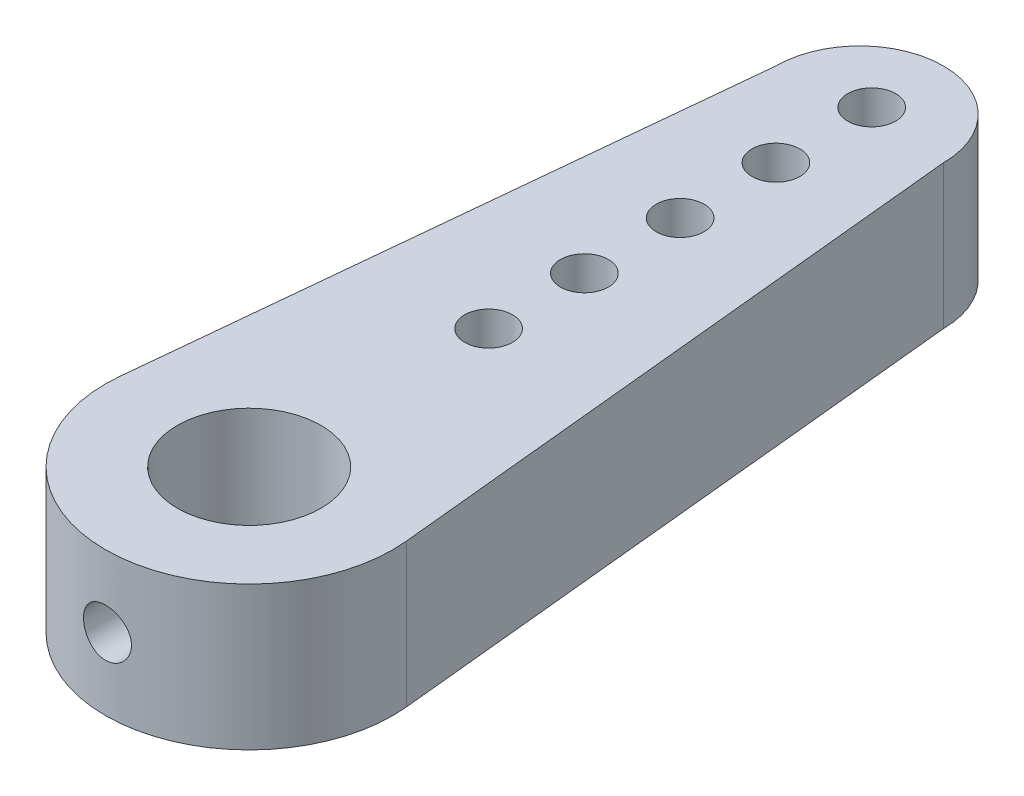
ISO-10303-21;
HEADER;
FILE_DESCRIPTION(('STEP AP214'),'2;1');
FILE_NAME('part.step','',(''),(''),'','','');
FILE_SCHEMA(('AUTOMOTIVE_DESIGN { 1 0 10303 214 1 1 1 1 }'));
ENDSEC;
DATA;
#1=APPLICATION_CONTEXT('core data for automotive mechanical design processes');
#2=APPLICATION_PROTOCOL_DEFINITION('international standard','automotive_design',2000,#1);
#3=PRODUCT_CONTEXT('',#1,'mechanical');
#4=PRODUCT('Part','Part','',(#3));
#5=PRODUCT_RELATED_PRODUCT_CATEGORY('part','',(#4));
#6=PRODUCT_DEFINITION_FORMATION('','',#4);
#7=PRODUCT_DEFINITION_CONTEXT('part definition',#1,'design');
#8=PRODUCT_DEFINITION('design','',#6,#7);
#9=PRODUCT_DEFINITION_SHAPE('','',#8);
#10=(LENGTH_UNIT() NAMED_UNIT(*) SI_UNIT(.MILLI.,.METRE.));
#11=(NAMED_UNIT(*) PLANE_ANGLE_UNIT() SI_UNIT($,.RADIAN.));
#12=(NAMED_UNIT(*) SI_UNIT($,.STERADIAN.) SOLID_ANGLE_UNIT());
#13=UNCERTAINTY_MEASURE_WITH_UNIT(LENGTH_MEASURE(1.E-05),#10,'distance_accuracy_value','');
#14=(GEOMETRIC_REPRESENTATION_CONTEXT(3) GLOBAL_UNCERTAINTY_ASSIGNED_CONTEXT((#13)) GLOBAL_UNIT_ASSIGNED_CONTEXT((#10,
#11,#12)) REPRESENTATION_CONTEXT('',''));
#15=CARTESIAN_POINT('',(0.,0.,0.));
#16=DIRECTION('',(0.,0.,1.));
#17=DIRECTION('',(1.,0.,0.));
#18=AXIS2_PLACEMENT_3D('',#15,#16,#17);
#19=CARTESIAN_POINT('',(0.,3.,-12.75));
#20=DIRECTION('',(0.,1.,0.));
#21=DIRECTION('',(0.,0.,1.));
#22=AXIS2_PLACEMENT_3D('',#19,#20,#21);
#23=PLANE('',#22);
#24=CARTESIAN_POINT('',(0.,3.,-11.));
#25=DIRECTION('',(0.,1.,0.));
#26=DIRECTION('',(0.,0.,1.));
#27=AXIS2_PLACEMENT_3D('',#24,#25,#26);
#28=CIRCLE('',#27,0.5);
#29=CARTESIAN_POINT('',(0.,3.,-10.5));
#30=VERTEX_POINT('',#29);
#31=EDGE_CURVE('E167',#30,#30,#28,.T.);
#32=ORIENTED_EDGE('',*,*,#31,.F.);
#33=EDGE_LOOP('',(#32));
#34=FACE_BOUND('',#33,.T.);
#35=CARTESIAN_POINT('',(0.,3.,-5.));
#36=DIRECTION('',(0.,1.,0.));
#37=DIRECTION('',(0.,0.,1.));
#38=AXIS2_PLACEMENT_3D('',#35,#36,#37);
#39=CIRCLE('',#38,0.5);
#40=CARTESIAN_POINT('',(0.,3.,-4.5));
#41=VERTEX_POINT('',#40);
#42=EDGE_CURVE('E151',#41,#41,#39,.T.);
#43=ORIENTED_EDGE('',*,*,#42,.F.);
#44=EDGE_LOOP('',(#43));
#45=FACE_BOUND('',#44,.T.);
#46=CARTESIAN_POINT('',(0.,3.,0.));
#47=DIRECTION('',(0.,1.,0.));
#48=DIRECTION('',(0.,0.,1.));
#49=AXIS2_PLACEMENT_3D('',#46,#47,#48);
#50=CIRCLE('',#49,1.5);
#51=CARTESIAN_POINT('',(0.,3.,1.5));
#52=VERTEX_POINT('',#51);
#53=EDGE_CURVE('E121',#52,#52,#50,.T.);
#54=ORIENTED_EDGE('',*,*,#53,.F.);
#55=EDGE_LOOP('',(#54));
#56=FACE_BOUND('',#55,.T.);
#57=CARTESIAN_POINT('',(0.,3.,-12.75));
#58=DIRECTION('',(0.,1.,0.));
#59=DIRECTION('',(0.,0.,1.));
#60=AXIS2_PLACEMENT_3D('',#57,#58,#59);
#61=CIRCLE('',#60,1.75);
#62=CARTESIAN_POINT('',(1.75,3.,-12.75));
#63=VERTEX_POINT('',#62);
#64=CARTESIAN_POINT('',(-1.75,3.,-12.75));
#65=VERTEX_POINT('',#64);
#66=EDGE_CURVE('E100',#63,#65,#61,.T.);
#67=ORIENTED_EDGE('',*,*,#66,.T.);
#68=DIRECTION('',(-0.0987095289426616,0.,0.995116289132038));
#69=VECTOR('',#68,1.);
#70=CARTESIAN_POINT('',(-1.75,3.,-12.75));
#71=LINE('',#70,#69);
#72=CARTESIAN_POINT('',(-2.98534886739612,3.,-0.296128586827985));
#73=VERTEX_POINT('',#72);
#74=EDGE_CURVE('E95',#65,#73,#71,.T.);
#75=ORIENTED_EDGE('',*,*,#74,.T.);
#76=CARTESIAN_POINT('',(0.,3.,0.));
#77=DIRECTION('',(0.,1.,0.));
#78=DIRECTION('',(0.,0.,1.));
#79=AXIS2_PLACEMENT_3D('',#76,#77,#78);
#80=CIRCLE('',#79,3.);
#81=CARTESIAN_POINT('',(2.98534886739612,3.,-0.296128586827985));
#82=VERTEX_POINT('',#81);
#83=EDGE_CURVE('E98',#73,#82,#80,.T.);
#84=ORIENTED_EDGE('',*,*,#83,.T.);
#85=DIRECTION('',(-0.0987095289426616,0.,-0.995116289132038));
#86=VECTOR('',#85,1.);
#87=CARTESIAN_POINT('',(1.75,3.,-12.75));
#88=LINE('',#87,#86);
#89=EDGE_CURVE('E65',#82,#63,#88,.T.);
#90=ORIENTED_EDGE('',*,*,#89,.T.);
#91=EDGE_LOOP('',(#67,#75,#84,#90));
#92=FACE_BOUND('',#91,.T.);
#93=CARTESIAN_POINT('',(0.,3.,-7.));
#94=DIRECTION('',(0.,1.,0.));
#95=DIRECTION('',(0.,0.,1.));
#96=AXIS2_PLACEMENT_3D('',#93,#94,#95);
#97=CIRCLE('',#96,0.5);
#98=CARTESIAN_POINT('',(0.,3.,-6.5));
#99=VERTEX_POINT('',#98);
#100=EDGE_CURVE('E143',#99,#99,#97,.T.);
#101=ORIENTED_EDGE('',*,*,#100,.F.);
#102=EDGE_LOOP('',(#101));
#103=FACE_BOUND('',#102,.T.);
#104=CARTESIAN_POINT('',(0.,3.,-9.));
#105=DIRECTION('',(0.,1.,0.));
#106=DIRECTION('',(0.,0.,1.));
#107=AXIS2_PLACEMENT_3D('',#104,#105,#106);
#108=CIRCLE('',#107,0.5);
#109=CARTESIAN_POINT('',(0.,3.,-8.5));
#110=VERTEX_POINT('',#109);
#111=EDGE_CURVE('E159',#110,#110,#108,.T.);
#112=ORIENTED_EDGE('',*,*,#111,.F.);
#113=EDGE_LOOP('',(#112));
#114=FACE_BOUND('',#113,.T.);
#115=CARTESIAN_POINT('',(0.,3.,-13.));
#116=DIRECTION('',(0.,1.,0.));
#117=DIRECTION('',(0.,0.,1.));
#118=AXIS2_PLACEMENT_3D('',#115,#116,#117);
#119=CIRCLE('',#118,0.5);
#120=CARTESIAN_POINT('',(0.,3.,-12.5));
#121=VERTEX_POINT('',#120);
#122=EDGE_CURVE('E175',#121,#121,#119,.T.);
#123=ORIENTED_EDGE('',*,*,#122,.F.);
#124=EDGE_LOOP('',(#123));
#125=FACE_BOUND('',#124,.T.);
#126=ADVANCED_FACE('F41',(#34,#45,#56,#92,#103,#114,#125),#23,.T.);
#127=CARTESIAN_POINT('',(0.,0.,-12.75));
#128=DIRECTION('',(0.,1.,0.));
#129=DIRECTION('',(0.,0.,1.));
#130=AXIS2_PLACEMENT_3D('',#127,#128,#129);
#131=PLANE('',#130);
#132=CARTESIAN_POINT('',(0.,0.,-12.75));
#133=DIRECTION('',(0.,1.,0.));
#134=DIRECTION('',(0.,0.,1.));
#135=AXIS2_PLACEMENT_3D('',#132,#133,#134);
#136=CIRCLE('',#135,1.75);
#137=CARTESIAN_POINT('',(1.75,0.,-12.75));
#138=VERTEX_POINT('',#137);
#139=CARTESIAN_POINT('',(-1.75,0.,-12.75));
#140=VERTEX_POINT('',#139);
#141=EDGE_CURVE('E117',#138,#140,#136,.T.);
#142=ORIENTED_EDGE('',*,*,#141,.F.);
#143=DIRECTION('',(-0.0987095289426616,0.,-0.995116289132038));
#144=VECTOR('',#143,1.);
#145=CARTESIAN_POINT('',(1.75,0.,-12.75));
#146=LINE('',#145,#144);
#147=CARTESIAN_POINT('',(2.98534886739612,0.,-0.296128586827985));
#148=VERTEX_POINT('',#147);
#149=EDGE_CURVE('E88',#148,#138,#146,.T.);
#150=ORIENTED_EDGE('',*,*,#149,.F.);
#151=CARTESIAN_POINT('',(0.,0.,0.));
#152=DIRECTION('',(0.,1.,0.));
#153=DIRECTION('',(0.,0.,1.));
#154=AXIS2_PLACEMENT_3D('',#151,#152,#153);
#155=CIRCLE('',#154,3.);
#156=CARTESIAN_POINT('',(-2.98534886739612,0.,-0.296128586827985));
#157=VERTEX_POINT('',#156);
#158=EDGE_CURVE('E82',#157,#148,#155,.T.);
#159=ORIENTED_EDGE('',*,*,#158,.F.);
#160=DIRECTION('',(-0.0987095289426616,0.,0.995116289132038));
#161=VECTOR('',#160,1.);
#162=CARTESIAN_POINT('',(-1.75,0.,-12.75));
#163=LINE('',#162,#161);
#164=EDGE_CURVE('E105',#140,#157,#163,.T.);
#165=ORIENTED_EDGE('',*,*,#164,.F.);
#166=EDGE_LOOP('',(#142,#150,#159,#165));
#167=FACE_BOUND('',#166,.T.);
#168=CARTESIAN_POINT('',(0.,0.,0.));
#169=DIRECTION('',(0.,1.,0.));
#170=DIRECTION('',(0.,0.,1.));
#171=AXIS2_PLACEMENT_3D('',#168,#169,#170);
#172=CIRCLE('',#171,1.5);
#173=CARTESIAN_POINT('',(0.,0.,1.5));
#174=VERTEX_POINT('',#173);
#175=EDGE_CURVE('E139',#174,#174,#172,.T.);
#176=ORIENTED_EDGE('',*,*,#175,.T.);
#177=EDGE_LOOP('',(#176));
#178=FACE_BOUND('',#177,.T.);
#179=CARTESIAN_POINT('',(0.,0.,-7.));
#180=DIRECTION('',(0.,1.,0.));
#181=DIRECTION('',(0.,0.,1.));
#182=AXIS2_PLACEMENT_3D('',#179,#180,#181);
#183=CIRCLE('',#182,0.5);
#184=CARTESIAN_POINT('',(0.,0.,-6.5));
#185=VERTEX_POINT('',#184);
#186=EDGE_CURVE('E147',#185,#185,#183,.T.);
#187=ORIENTED_EDGE('',*,*,#186,.T.);
#188=EDGE_LOOP('',(#187));
#189=FACE_BOUND('',#188,.T.);
#190=CARTESIAN_POINT('',(0.,0.,-5.));
#191=DIRECTION('',(0.,1.,0.));
#192=DIRECTION('',(0.,0.,1.));
#193=AXIS2_PLACEMENT_3D('',#190,#191,#192);
#194=CIRCLE('',#193,0.5);
#195=CARTESIAN_POINT('',(0.,0.,-4.5));
#196=VERTEX_POINT('',#195);
#197=EDGE_CURVE('E155',#196,#196,#194,.T.);
#198=ORIENTED_EDGE('',*,*,#197,.T.);
#199=EDGE_LOOP('',(#198));
#200=FACE_BOUND('',#199,.T.);
#201=CARTESIAN_POINT('',(0.,0.,-9.));
#202=DIRECTION('',(0.,1.,0.));
#203=DIRECTION('',(0.,0.,1.));
#204=AXIS2_PLACEMENT_3D('',#201,#202,#203);
#205=CIRCLE('',#204,0.5);
#206=CARTESIAN_POINT('',(0.,0.,-8.5));
#207=VERTEX_POINT('',#206);
#208=EDGE_CURVE('E163',#207,#207,#205,.T.);
#209=ORIENTED_EDGE('',*,*,#208,.T.);
#210=EDGE_LOOP('',(#209));
#211=FACE_BOUND('',#210,.T.);
#212=CARTESIAN_POINT('',(0.,0.,-11.));
#213=DIRECTION('',(0.,1.,0.));
#214=DIRECTION('',(0.,0.,1.));
#215=AXIS2_PLACEMENT_3D('',#212,#213,#214);
#216=CIRCLE('',#215,0.5);
#217=CARTESIAN_POINT('',(0.,0.,-10.5));
#218=VERTEX_POINT('',#217);
#219=EDGE_CURVE('E171',#218,#218,#216,.T.);
#220=ORIENTED_EDGE('',*,*,#219,.T.);
#221=EDGE_LOOP('',(#220));
#222=FACE_BOUND('',#221,.T.);
#223=CARTESIAN_POINT('',(0.,0.,-13.));
#224=DIRECTION('',(0.,1.,0.));
#225=DIRECTION('',(0.,0.,1.));
#226=AXIS2_PLACEMENT_3D('',#223,#224,#225);
#227=CIRCLE('',#226,0.5);
#228=CARTESIAN_POINT('',(0.,0.,-12.5));
#229=VERTEX_POINT('',#228);
#230=EDGE_CURVE('E179',#229,#229,#227,.T.);
#231=ORIENTED_EDGE('',*,*,#230,.T.);
#232=EDGE_LOOP('',(#231));
#233=FACE_BOUND('',#232,.T.);
#234=ADVANCED_FACE('F134',(#167,#178,#189,#200,#211,#222,#233),#131,.F.);
#235=CARTESIAN_POINT('',(0.,3.,-12.75));
#236=DIRECTION('',(0.,-1.,0.));
#237=DIRECTION('',(0.,0.,-1.));
#238=AXIS2_PLACEMENT_3D('',#235,#236,#237);
#239=CYLINDRICAL_SURFACE('',#238,1.75);
#240=ORIENTED_EDGE('',*,*,#141,.T.);
#241=DIRECTION('',(0.,-1.,0.));
#242=VECTOR('',#241,1.);
#243=CARTESIAN_POINT('',(-1.75,3.,-12.75));
#244=LINE('',#243,#242);
#245=EDGE_CURVE('E11',#65,#140,#244,.T.);
#246=ORIENTED_EDGE('',*,*,#245,.F.);
#247=ORIENTED_EDGE('',*,*,#66,.F.);
#248=DIRECTION('',(0.,-1.,0.));
#249=VECTOR('',#248,1.);
#250=CARTESIAN_POINT('',(1.75,3.,-12.75));
#251=LINE('',#250,#249);
#252=EDGE_CURVE('E113',#63,#138,#251,.T.);
#253=ORIENTED_EDGE('',*,*,#252,.T.);
#254=EDGE_LOOP('',(#240,#246,#247,#253));
#255=FACE_BOUND('',#254,.T.);
#256=ADVANCED_FACE('F43',(#255),#239,.T.);
#257=CARTESIAN_POINT('',(-1.75,3.,-12.75));
#258=DIRECTION('',(0.995116289132038,0.,0.0987095289426616));
#259=DIRECTION('',(0.0987095289426616,0.,-0.995116289132038));
#260=AXIS2_PLACEMENT_3D('',#257,#258,#259);
#261=PLANE('',#260);
#262=ORIENTED_EDGE('',*,*,#164,.T.);
#263=DIRECTION('',(0.,-1.,0.));
#264=VECTOR('',#263,1.);
#265=CARTESIAN_POINT('',(-2.98534886739612,3.,-0.296128586827985));
#266=LINE('',#265,#264);
#267=EDGE_CURVE('E57',#73,#157,#266,.T.);
#268=ORIENTED_EDGE('',*,*,#267,.F.);
#269=ORIENTED_EDGE('',*,*,#74,.F.);
#270=ORIENTED_EDGE('',*,*,#245,.T.);
#271=EDGE_LOOP('',(#262,#268,#269,#270));
#272=FACE_BOUND('',#271,.T.);
#273=ADVANCED_FACE('F104',(#272),#261,.F.);
#274=CARTESIAN_POINT('',(0.,3.,0.));
#275=DIRECTION('',(0.,-1.,0.));
#276=DIRECTION('',(0.,0.,-1.));
#277=AXIS2_PLACEMENT_3D('',#274,#275,#276);
#278=CYLINDRICAL_SURFACE('',#277,3.);
#279=CARTESIAN_POINT('',(0.5,1.5,2.95803989154981));
#280=CARTESIAN_POINT('',(0.499998879684201,1.47212485037079,2.95804039480255));
#281=CARTESIAN_POINT('',(0.497661033807465,1.44423447879503,2.95843818509613));
#282=CARTESIAN_POINT('',(0.488375485615079,1.38923629135597,2.95998491473636));
#283=CARTESIAN_POINT('',(0.481423532061931,1.3621292212501,2.96113454678286));
#284=CARTESIAN_POINT('',(0.463125908733429,1.30950154332864,2.96405121864465));
#285=CARTESIAN_POINT('',(0.451783910986218,1.28397963026674,2.9658177423439));
#286=CARTESIAN_POINT('',(0.425037299378074,1.23520380905726,2.96976854422868));
#287=CARTESIAN_POINT('',(0.409633142700314,1.21194964608475,2.97195277539495));
#288=CARTESIAN_POINT('',(0.37503750539326,1.16813743005087,2.97651694230522));
#289=CARTESIAN_POINT('',(0.355813809786455,1.1476049737227,2.97889843465414));
#290=CARTESIAN_POINT('',(0.314194400939068,1.1100413386277,2.98357496133892));
#291=CARTESIAN_POINT('',(0.291798499829998,1.09301036737693,2.98586999054394));
#292=CARTESIAN_POINT('',(0.244304573989668,1.06283708655613,2.99013147396494));
#293=CARTESIAN_POINT('',(0.219191216291341,1.04971859845364,2.99209588486455));
#294=CARTESIAN_POINT('',(0.167079124344775,1.02789578589389,2.99545747391431));
#295=CARTESIAN_POINT('',(0.140080512815638,1.01919117442303,2.99685468894535));
#296=CARTESIAN_POINT('',(0.0852287452688485,1.00652149300322,2.99891346944876));
#297=CARTESIAN_POINT('',(0.0573857773358544,1.00251341679906,2.99958170622181));
#298=CARTESIAN_POINT('',(0.00141505710515978,0.999216849169481,3.00013015868556));
#299=CARTESIAN_POINT('',(-0.0267126757057794,0.999928036950553,3.00001042793862));
#300=CARTESIAN_POINT('',(-0.0821604370157749,1.00601627030564,2.99900171686278));
#301=CARTESIAN_POINT('',(-0.109485706140028,1.01134703268183,2.9981203673848));
#302=CARTESIAN_POINT('',(-0.162848395922358,1.0264502148493,2.99569595754327));
#303=CARTESIAN_POINT('',(-0.1888857773303,1.0362227699179,2.99415287702642));
#304=CARTESIAN_POINT('',(-0.239071229556529,1.05997812806306,2.99056539702392));
#305=CARTESIAN_POINT('',(-0.263210104603809,1.07398000241649,2.98851873465376));
#306=CARTESIAN_POINT('',(-0.308813105969328,1.10578256452701,2.984151476143));
#307=CARTESIAN_POINT('',(-0.330277015583175,1.12358355974216,2.98183085783827));
#308=CARTESIAN_POINT('',(-0.370194254689333,1.16273576132386,2.97714053646519));
#309=CARTESIAN_POINT('',(-0.388607900450641,1.1841274189802,2.97477057946208));
#310=CARTESIAN_POINT('',(-0.421590917689612,1.22971741804316,2.97027591956961));
#311=CARTESIAN_POINT('',(-0.436160253706483,1.25391578533656,2.96815121894265));
#312=CARTESIAN_POINT('',(-0.461048886897657,1.3044783283755,2.96438750912363));
#313=CARTESIAN_POINT('',(-0.471363405455848,1.33084489961842,2.9627490466052));
#314=CARTESIAN_POINT('',(-0.487405974163123,1.38496981446151,2.96015237737976));
#315=CARTESIAN_POINT('',(-0.493134428153591,1.41272803528648,2.95919411077664));
#316=CARTESIAN_POINT('',(-0.499786376975853,1.46849323123243,2.95807791884423));
#317=CARTESIAN_POINT('',(-0.500766441582488,1.49649327594042,2.95791057151734));
#318=CARTESIAN_POINT('',(-0.498044540536491,1.55225733433816,2.95837006956472));
#319=CARTESIAN_POINT('',(-0.494342755724932,1.58002135710279,2.95899688426371));
#320=CARTESIAN_POINT('',(-0.482410466985619,1.63434555183817,2.96096537491004));
#321=CARTESIAN_POINT('',(-0.474208758129277,1.6609122279756,2.9623025038367));
#322=CARTESIAN_POINT('',(-0.453539638038455,1.7122940332559,2.96553714601101));
#323=CARTESIAN_POINT('',(-0.441071971620187,1.73710905751018,2.96743469278116));
#324=CARTESIAN_POINT('',(-0.412091334645845,1.78453491888122,2.97159825679479));
#325=CARTESIAN_POINT('',(-0.395542112831872,1.80712331455121,2.9738675112007));
#326=CARTESIAN_POINT('',(-0.358917893141596,1.849222706539,2.97850933335973));
#327=CARTESIAN_POINT('',(-0.338842647276808,1.86873348622195,2.98088190837066));
#328=CARTESIAN_POINT('',(-0.295485614065761,1.90433037854574,2.98549284423653));
#329=CARTESIAN_POINT('',(-0.272172650677239,1.92037876525691,2.98772955268935));
#330=CARTESIAN_POINT('',(-0.223148689589865,1.94833106540098,2.99179022486589));
#331=CARTESIAN_POINT('',(-0.197437769494125,1.96023511289477,2.99361420193995));
#332=CARTESIAN_POINT('',(-0.144459810300265,1.97950211679097,2.99663671633917));
#333=CARTESIAN_POINT('',(-0.117200112520522,1.98688481514698,2.99783796913524));
#334=CARTESIAN_POINT('',(-0.0618061469748419,1.99696311979277,2.99949116633856));
#335=CARTESIAN_POINT('',(-0.0336719513643242,1.99965911174647,2.99994317240036));
#336=CARTESIAN_POINT('',(0.0223082551547368,2.00027637646244,3.00004607577565));
#337=CARTESIAN_POINT('',(0.0501536321205366,1.99825505078821,2.99970660404848));
#338=CARTESIAN_POINT('',(0.105102394862939,1.98961921554612,2.99828435677457));
#339=CARTESIAN_POINT('',(0.132205784793486,1.98300473169809,2.99720158539));
#340=CARTESIAN_POINT('',(0.184879289183719,1.96539236689125,2.99441397765517));
#341=CARTESIAN_POINT('',(0.210451074430805,1.95439936635791,2.99270983408311));
#342=CARTESIAN_POINT('',(0.259396090596393,1.92834841275396,2.9888655137547));
#343=CARTESIAN_POINT('',(0.282769217223493,1.91329026698781,2.98672531632976));
#344=CARTESIAN_POINT('',(0.326942589105432,1.8793329815076,2.98221525923795));
#345=CARTESIAN_POINT('',(0.347710286121123,1.86039180904862,2.97984304910147));
#346=CARTESIAN_POINT('',(0.385792775189609,1.81929433842036,2.97515260660951));
#347=CARTESIAN_POINT('',(0.403106757340238,1.79713728822169,2.97283438702721));
#348=CARTESIAN_POINT('',(0.433902854183923,1.75005093549847,2.9684966871402));
#349=CARTESIAN_POINT('',(0.447356997818908,1.72510313203239,2.96647943596247));
#350=CARTESIAN_POINT('',(0.469862907288183,1.67327815281771,2.96299842044354));
#351=CARTESIAN_POINT('',(0.478919071046321,1.64640293546062,2.96153410350255));
#352=CARTESIAN_POINT('',(0.490405210624429,1.59951924610467,2.95964948967556));
#353=CARTESIAN_POINT('',(0.493997483534056,1.57979463840831,2.95904924684204));
#354=CARTESIAN_POINT('',(0.498795259036485,1.54004930303178,2.95824427057304));
#355=CARTESIAN_POINT('',(0.500000804958385,1.52002858073397,2.95803952995755));
#356=CARTESIAN_POINT('',(0.5,1.5,2.95803989154981));
#357=B_SPLINE_CURVE_WITH_KNOTS('',3,(#279,#280,#281,#282,#283,#284,#285,#286,#287,#288,#289,
#290,#291,#292,#293,#294,#295,#296,#297,#298,#299,#300,#301,#302,#303,#304,#305,#306,#307,#308,
#309,#310,#311,#312,#313,#314,#315,#316,#317,#318,#319,#320,#321,#322,#323,#324,#325,#326,#327,
#328,#329,#330,#331,#332,#333,#334,#335,#336,#337,#338,#339,#340,#341,#342,#343,#344,#345,#346,
#347,#348,#349,#350,#351,#352,#353,#354,#355,#356),.UNSPECIFIED.,.T.,.F.,(4,2,2,2,2,2,2,2,2,2,2,
2,2,2,2,2,2,2,2,2,2,2,2,2,2,2,2,2,2,2,2,2,2,2,2,2,2,2,4),(0.,0.0835522077810638,
0.16718150398389,0.250740999566333,0.334291094801843,0.418578318302725,0.50287053566019,
0.587665960214166,0.672455870213522,0.756463134936426,0.84046468929668,0.923634242320633,
1.00680632849036,1.09035920827015,1.17391885244482,1.25849224691554,1.34306642148333,
1.4277353249885,1.51239677186745,1.59604708483212,1.67969416681925,1.76281212926228,
1.84593506457844,1.9298246855167,2.01372020885267,2.09848822606206,2.18325350094469,
2.26764596882659,2.352031491816,2.43539555252313,2.51875914642894,2.60203007965621,
2.68530496077597,2.7695339949178,2.85378275775492,2.9386274552257,3.02338713347525,
3.08342134107387,3.14345445878998),.UNSPECIFIED.);
#358=CARTESIAN_POINT('',(0.5,1.5,2.95803989154981));
#359=VERTEX_POINT('',#358);
#360=EDGE_CURVE('E183',#359,#359,#357,.T.);
#361=ORIENTED_EDGE('',*,*,#360,.T.);
#362=EDGE_LOOP('',(#361));
#363=FACE_BOUND('',#362,.T.);
#364=ORIENTED_EDGE('',*,*,#158,.T.);
#365=DIRECTION('',(0.,-1.,0.));
#366=VECTOR('',#365,1.);
#367=CARTESIAN_POINT('',(2.98534886739612,3.,-0.296128586827985));
#368=LINE('',#367,#366);
#369=EDGE_CURVE('E107',#82,#148,#368,.T.);
#370=ORIENTED_EDGE('',*,*,#369,.F.);
#371=ORIENTED_EDGE('',*,*,#83,.F.);
#372=ORIENTED_EDGE('',*,*,#267,.T.);
#373=EDGE_LOOP('',(#364,#370,#371,#372));
#374=FACE_BOUND('',#373,.T.);
#375=ADVANCED_FACE('F109',(#363,#374),#278,.T.);
#376=CARTESIAN_POINT('',(1.75,3.,-12.75));
#377=DIRECTION('',(-0.995116289132038,0.,0.0987095289426616));
#378=DIRECTION('',(0.0987095289426616,0.,0.995116289132038));
#379=AXIS2_PLACEMENT_3D('',#376,#377,#378);
#380=PLANE('',#379);
#381=ORIENTED_EDGE('',*,*,#149,.T.);
#382=ORIENTED_EDGE('',*,*,#252,.F.);
#383=ORIENTED_EDGE('',*,*,#89,.F.);
#384=ORIENTED_EDGE('',*,*,#369,.T.);
#385=EDGE_LOOP('',(#381,#382,#383,#384));
#386=FACE_BOUND('',#385,.T.);
#387=ADVANCED_FACE('F131',(#386),#380,.F.);
#388=CARTESIAN_POINT('',(0.,3.,0.));
#389=DIRECTION('',(0.,-1.,0.));
#390=DIRECTION('',(0.,0.,-1.));
#391=AXIS2_PLACEMENT_3D('',#388,#389,#390);
#392=CYLINDRICAL_SURFACE('',#391,1.5);
#393=CARTESIAN_POINT('',(0.5,1.5,1.4142135623731));
#394=CARTESIAN_POINT('',(0.500000128973902,1.47276591259466,1.41421347266367));
#395=CARTESIAN_POINT('',(0.49776739184907,1.44553260011424,1.41500884686403));
#396=CARTESIAN_POINT('',(0.488925565851282,1.39187278952469,1.4180878708729));
#397=CARTESIAN_POINT('',(0.482315756085337,1.36544642506803,1.4203717658361));
#398=CARTESIAN_POINT('',(0.464977742840132,1.31418655349359,1.42614101831944));
#399=CARTESIAN_POINT('',(0.454257610701001,1.28935003527656,1.4296240198232));
#400=CARTESIAN_POINT('',(0.429030814221314,1.2418199757281,1.43739561008504));
#401=CARTESIAN_POINT('',(0.414523314430262,1.21912690872375,1.44168437652716));
#402=CARTESIAN_POINT('',(0.381525573221264,1.17564001883026,1.45077244702794));
#403=CARTESIAN_POINT('',(0.362912170688913,1.15494228566398,1.45558447422069));
#404=CARTESIAN_POINT('',(0.322493833607245,1.11689659938784,1.46506932400754));
#405=CARTESIAN_POINT('',(0.300688387526201,1.09954918420886,1.46974212414549));
#406=CARTESIAN_POINT('',(0.253802253982493,1.06826055133516,1.47856933460829));
#407=CARTESIAN_POINT('',(0.22865095561226,1.05442001469101,1.48270703850784));
#408=CARTESIAN_POINT('',(0.176215611493741,1.03120420743626,1.4898479338551));
#409=CARTESIAN_POINT('',(0.148932142843608,1.02182773341155,1.49285143101506));
#410=CARTESIAN_POINT('',(0.0940144087167468,1.0081320726838,1.49729537715949));
#411=CARTESIAN_POINT('',(0.0664253774264841,1.0036482768715,1.49878657388779));
#412=CARTESIAN_POINT('',(0.0108489374120459,0.99934185331967,1.50021804109124));
#413=CARTESIAN_POINT('',(-0.017138366771946,0.999518024173791,1.50015871131445));
#414=CARTESIAN_POINT('',(-0.0715517575969083,1.00442212728302,1.49853019809368));
#415=CARTESIAN_POINT('',(-0.0979960242958331,1.00897126423725,1.49702032377569));
#416=CARTESIAN_POINT('',(-0.14972171941108,1.02219649049023,1.49273483669855));
#417=CARTESIAN_POINT('',(-0.175003068889587,1.03087285948988,1.48995913815551));
#418=CARTESIAN_POINT('',(-0.224076237421006,1.05221065865307,1.48337835146652));
#419=CARTESIAN_POINT('',(-0.247844110484499,1.06492296927339,1.47956021262158));
#420=CARTESIAN_POINT('',(-0.292962162763584,1.09392985272419,1.47129196519309));
#421=CARTESIAN_POINT('',(-0.314311667192383,1.11022542166331,1.46684168100171));
#422=CARTESIAN_POINT('',(-0.355050433275954,1.14683719673038,1.45753095925538));
#423=CARTESIAN_POINT('',(-0.374300078533783,1.16730657892277,1.45266107586687));
#424=CARTESIAN_POINT('',(-0.409138629797939,1.21122436286128,1.44323667622202));
#425=CARTESIAN_POINT('',(-0.424726971636482,1.23467322285643,1.43868220864403));
#426=CARTESIAN_POINT('',(-0.451993727521386,1.2843268128079,1.43035262569106));
#427=CARTESIAN_POINT('',(-0.4636132318256,1.31056606568463,1.42658954674447));
#428=CARTESIAN_POINT('',(-0.482221596649677,1.36478569713241,1.42040825434116));
#429=CARTESIAN_POINT('',(-0.48921239787748,1.3927653406082,1.41798947731819));
#430=CARTESIAN_POINT('',(-0.498080641044513,1.44831917769667,1.41489818169014));
#431=CARTESIAN_POINT('',(-0.500174547752903,1.47585471236968,1.41415180223172));
#432=CARTESIAN_POINT('',(-0.499802719455807,1.5308880745586,1.41428336096614));
#433=CARTESIAN_POINT('',(-0.497337812612854,1.55838590801528,1.41516100413602));
#434=CARTESIAN_POINT('',(-0.488112825775626,1.61157848285877,1.41836809028099));
#435=CARTESIAN_POINT('',(-0.4815031969902,1.63730271507617,1.42064662715846));
#436=CARTESIAN_POINT('',(-0.464356931280375,1.68727180311884,1.42634276840086));
#437=CARTESIAN_POINT('',(-0.453819598181749,1.71151639579518,1.42976057468663));
#438=CARTESIAN_POINT('',(-0.428737170369428,1.75869021042371,1.4374843879661));
#439=CARTESIAN_POINT('',(-0.414075559179237,1.78155332132096,1.4418151283247));
#440=CARTESIAN_POINT('',(-0.381292815278789,1.8245730261918,1.45082884365827));
#441=CARTESIAN_POINT('',(-0.363170662749394,1.84472881933059,1.45551192221992));
#442=CARTESIAN_POINT('',(-0.322945852950159,1.88276399204534,1.46497519318826));
#443=CARTESIAN_POINT('',(-0.300693635273325,1.90048719500943,1.46974921788922));
#444=CARTESIAN_POINT('',(-0.253413645700129,1.93195807117402,1.47863425806581));
#445=CARTESIAN_POINT('',(-0.228385972432276,1.94570588558121,1.48274529708854));
#446=CARTESIAN_POINT('',(-0.176389931216147,1.96871005243086,1.48982202905295));
#447=CARTESIAN_POINT('',(-0.149435561660598,1.97799563857403,1.49279515002264));
#448=CARTESIAN_POINT('',(-0.0942292329230079,1.99186387103005,1.49729305418889));
#449=CARTESIAN_POINT('',(-0.0659777459769444,1.99644821494025,1.4988183601701));
#450=CARTESIAN_POINT('',(-0.01040766793002,2.00063103880282,1.50020931618128));
#451=CARTESIAN_POINT('',(0.0168923619600099,2.00045372696619,1.50014960044721));
#452=CARTESIAN_POINT('',(0.0710555725000871,1.9956713459268,1.49856098259698));
#453=CARTESIAN_POINT('',(0.0979187884095279,1.99106663592362,1.49703219966784));
#454=CARTESIAN_POINT('',(0.150021059716031,1.97770888271202,1.4927045747721));
#455=CARTESIAN_POINT('',(0.175279135456398,1.96902289232352,1.4899262918059));
#456=CARTESIAN_POINT('',(0.223989175469895,1.94781123445143,1.48338580352232));
#457=CARTESIAN_POINT('',(0.247440812071205,1.93528487240153,1.4796234202395));
#458=CARTESIAN_POINT('',(0.292817008154405,1.90621524394896,1.47132934414));
#459=CARTESIAN_POINT('',(0.314653125778848,1.88954065730904,1.46677436246191));
#460=CARTESIAN_POINT('',(0.355290513136169,1.85287130442204,1.45746494395712));
#461=CARTESIAN_POINT('',(0.37409081081213,1.83287547886916,1.45271044385698));
#462=CARTESIAN_POINT('',(0.408870904416732,1.78919532220598,1.44331639913682));
#463=CARTESIAN_POINT('',(0.424711482999608,1.76539724450962,1.43868863997672));
#464=CARTESIAN_POINT('',(0.4521571716499,1.71533278655067,1.43030096658152));
#465=CARTESIAN_POINT('',(0.46376338840728,1.68906705349288,1.42654082568085));
#466=CARTESIAN_POINT('',(0.481921914103314,1.63601908798808,1.42050667115267));
#467=CARTESIAN_POINT('',(0.488678954581634,1.60931386821714,1.418173164724));
#468=CARTESIAN_POINT('',(0.497717160080847,1.55507197474226,1.4150269180697));
#469=CARTESIAN_POINT('',(0.499999869598251,1.52753559128213,1.41421365307568));
#470=CARTESIAN_POINT('',(0.5,1.5,1.4142135623731));
#471=B_SPLINE_CURVE_WITH_KNOTS('',3,(#393,#394,#395,#396,#397,#398,#399,#400,#401,#402,#403,
#404,#405,#406,#407,#408,#409,#410,#411,#412,#413,#414,#415,#416,#417,#418,#419,#420,#421,#422,
#423,#424,#425,#426,#427,#428,#429,#430,#431,#432,#433,#434,#435,#436,#437,#438,#439,#440,#441,
#442,#443,#444,#445,#446,#447,#448,#449,#450,#451,#452,#453,#454,#455,#456,#457,#458,#459,#460,
#461,#462,#463,#464,#465,#466,#467,#468,#469,#470),.UNSPECIFIED.,.T.,.F.,(4,2,2,2,2,2,2,2,2,2,2,
2,2,2,2,2,2,2,2,2,2,2,2,2,2,2,2,2,2,2,2,2,2,2,2,2,2,2,4),(0.,0.0816002923877085,
0.16321402748444,0.244668313727272,0.326140583069579,0.410506687114699,0.494886325836798,
0.581467530695144,0.668025381910803,0.751571593801529,0.835096266488494,0.915345024104703,
0.995599220923041,1.07690827427853,1.15823995934697,1.24340087179645,1.32857489803739,
1.41496319918688,1.50131525674844,1.58377145676863,1.66621267911373,1.74582197877144,
1.82544539566229,1.90759428860613,1.9897674282382,2.07589404078302,2.16201759371522,
2.24756895588182,2.33308941494834,2.41459042331574,2.49608481997646,2.57628478012971,
2.65649925374377,2.73967759753073,2.82288252209072,2.90934451360828,2.99578389126189,
3.07831606073062,3.16081973585834),.UNSPECIFIED.);
#472=CARTESIAN_POINT('',(0.5,1.5,1.4142135623731));
#473=VERTEX_POINT('',#472);
#474=EDGE_CURVE('E45',#473,#473,#471,.T.);
#475=ORIENTED_EDGE('',*,*,#474,.F.);
#476=EDGE_LOOP('',(#475));
#477=FACE_BOUND('',#476,.T.);
#478=ORIENTED_EDGE('',*,*,#53,.T.);
#479=EDGE_LOOP('',(#478));
#480=FACE_BOUND('',#479,.T.);
#481=ORIENTED_EDGE('',*,*,#175,.F.);
#482=EDGE_LOOP('',(#481));
#483=FACE_BOUND('',#482,.T.);
#484=ADVANCED_FACE('F219',(#477,#480,#483),#392,.F.);
#485=CARTESIAN_POINT('',(0.,3.,-7.));
#486=DIRECTION('',(0.,-1.,0.));
#487=DIRECTION('',(0.,0.,-1.));
#488=AXIS2_PLACEMENT_3D('',#485,#486,#487);
#489=CYLINDRICAL_SURFACE('',#488,0.5);
#490=ORIENTED_EDGE('',*,*,#100,.T.);
#491=EDGE_LOOP('',(#490));
#492=FACE_BOUND('',#491,.T.);
#493=ORIENTED_EDGE('',*,*,#186,.F.);
#494=EDGE_LOOP('',(#493));
#495=FACE_BOUND('',#494,.T.);
#496=ADVANCED_FACE('F216',(#492,#495),#489,.F.);
#497=CARTESIAN_POINT('',(0.,3.,-5.));
#498=DIRECTION('',(0.,-1.,0.));
#499=DIRECTION('',(0.,0.,-1.));
#500=AXIS2_PLACEMENT_3D('',#497,#498,#499);
#501=CYLINDRICAL_SURFACE('',#500,0.5);
#502=ORIENTED_EDGE('',*,*,#42,.T.);
#503=EDGE_LOOP('',(#502));
#504=FACE_BOUND('',#503,.T.);
#505=ORIENTED_EDGE('',*,*,#197,.F.);
#506=EDGE_LOOP('',(#505));
#507=FACE_BOUND('',#506,.T.);
#508=ADVANCED_FACE('F212',(#504,#507),#501,.F.);
#509=CARTESIAN_POINT('',(0.,3.,-9.));
#510=DIRECTION('',(0.,-1.,0.));
#511=DIRECTION('',(0.,0.,-1.));
#512=AXIS2_PLACEMENT_3D('',#509,#510,#511);
#513=CYLINDRICAL_SURFACE('',#512,0.5);
#514=ORIENTED_EDGE('',*,*,#111,.T.);
#515=EDGE_LOOP('',(#514));
#516=FACE_BOUND('',#515,.T.);
#517=ORIENTED_EDGE('',*,*,#208,.F.);
#518=EDGE_LOOP('',(#517));
#519=FACE_BOUND('',#518,.T.);
#520=ADVANCED_FACE('F208',(#516,#519),#513,.F.);
#521=CARTESIAN_POINT('',(0.,3.,-11.));
#522=DIRECTION('',(0.,-1.,0.));
#523=DIRECTION('',(0.,0.,-1.));
#524=AXIS2_PLACEMENT_3D('',#521,#522,#523);
#525=CYLINDRICAL_SURFACE('',#524,0.5);
#526=ORIENTED_EDGE('',*,*,#31,.T.);
#527=EDGE_LOOP('',(#526));
#528=FACE_BOUND('',#527,.T.);
#529=ORIENTED_EDGE('',*,*,#219,.F.);
#530=EDGE_LOOP('',(#529));
#531=FACE_BOUND('',#530,.T.);
#532=ADVANCED_FACE('F204',(#528,#531),#525,.F.);
#533=CARTESIAN_POINT('',(0.,3.,-13.));
#534=DIRECTION('',(0.,-1.,0.));
#535=DIRECTION('',(0.,0.,-1.));
#536=AXIS2_PLACEMENT_3D('',#533,#534,#535);
#537=CYLINDRICAL_SURFACE('',#536,0.5);
#538=ORIENTED_EDGE('',*,*,#122,.T.);
#539=EDGE_LOOP('',(#538));
#540=FACE_BOUND('',#539,.T.);
#541=ORIENTED_EDGE('',*,*,#230,.F.);
#542=EDGE_LOOP('',(#541));
#543=FACE_BOUND('',#542,.T.);
#544=ADVANCED_FACE('F199',(#540,#543),#537,.F.);
#545=CARTESIAN_POINT('',(0.,1.5,0.));
#546=DIRECTION('',(0.,0.,1.));
#547=DIRECTION('',(1.,0.,0.));
#548=AXIS2_PLACEMENT_3D('',#545,#546,#547);
#549=CYLINDRICAL_SURFACE('',#548,0.5);
#550=ORIENTED_EDGE('',*,*,#474,.T.);
#551=EDGE_LOOP('',(#550));
#552=FACE_BOUND('',#551,.T.);
#553=ORIENTED_EDGE('',*,*,#360,.F.);
#554=EDGE_LOOP('',(#553));
#555=FACE_BOUND('',#554,.T.);
#556=ADVANCED_FACE('F195',(#552,#555),#549,.F.);
#557=CLOSED_SHELL('',(#126,#234,#256,#273,#375,#387,#484,#496,#508,#520,#532,#544,#556));
#558=MANIFOLD_SOLID_BREP('B2',#557);
#559=ADVANCED_BREP_SHAPE_REPRESENTATION('',(#18,#558),#14);
#560=SHAPE_DEFINITION_REPRESENTATION(#9,#559);
ENDSEC;
END-ISO-10303-21;
